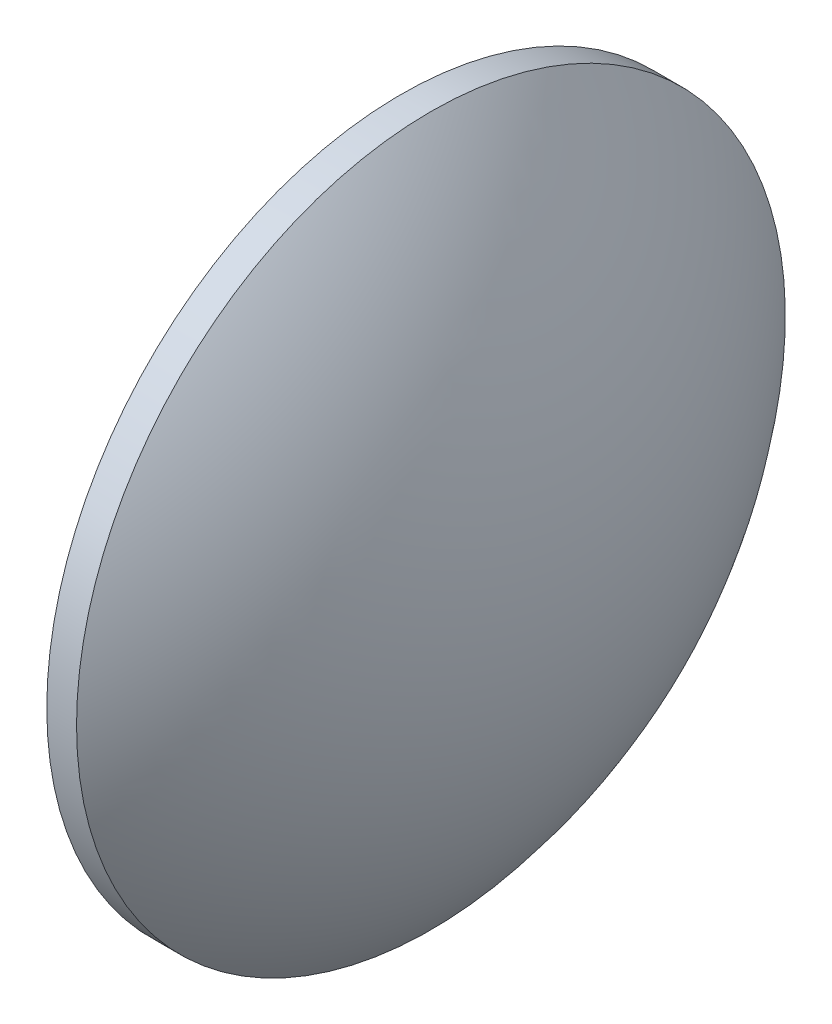
ISO-10303-21;
HEADER;
FILE_DESCRIPTION(('STEP AP214'),'2;1');
FILE_NAME('part.step','',(''),(''),'','','');
FILE_SCHEMA(('AUTOMOTIVE_DESIGN { 1 0 10303 214 1 1 1 1 }'));
ENDSEC;
DATA;
#1=APPLICATION_CONTEXT('core data for automotive mechanical design processes');
#2=APPLICATION_PROTOCOL_DEFINITION('international standard','automotive_design',2000,#1);
#3=PRODUCT_CONTEXT('',#1,'mechanical');
#4=PRODUCT('Part','Part','',(#3));
#5=PRODUCT_RELATED_PRODUCT_CATEGORY('part','',(#4));
#6=PRODUCT_DEFINITION_FORMATION('','',#4);
#7=PRODUCT_DEFINITION_CONTEXT('part definition',#1,'design');
#8=PRODUCT_DEFINITION('design','',#6,#7);
#9=PRODUCT_DEFINITION_SHAPE('','',#8);
#10=(LENGTH_UNIT() NAMED_UNIT(*) SI_UNIT(.MILLI.,.METRE.));
#11=(NAMED_UNIT(*) PLANE_ANGLE_UNIT() SI_UNIT($,.RADIAN.));
#12=(NAMED_UNIT(*) SI_UNIT($,.STERADIAN.) SOLID_ANGLE_UNIT());
#13=UNCERTAINTY_MEASURE_WITH_UNIT(LENGTH_MEASURE(1.E-05),#10,'distance_accuracy_value','');
#14=(GEOMETRIC_REPRESENTATION_CONTEXT(3) GLOBAL_UNCERTAINTY_ASSIGNED_CONTEXT((#13)) GLOBAL_UNIT_ASSIGNED_CONTEXT((#10,
#11,#12)) REPRESENTATION_CONTEXT('',''));
#15=CARTESIAN_POINT('',(0.,0.,0.));
#16=DIRECTION('',(0.,0.,1.));
#17=DIRECTION('',(1.,0.,0.));
#18=AXIS2_PLACEMENT_3D('',#15,#16,#17);
#19=CARTESIAN_POINT('',(490.57632551327,160.834227069943,0.));
#20=DIRECTION('',(-1.,0.,0.));
#21=DIRECTION('',(0.,1.,0.));
#22=AXIS2_PLACEMENT_3D('',#19,#20,#21);
#23=SPHERICAL_SURFACE('',#22,15.4912021857924);
#24=CARTESIAN_POINT('',(502.407527699062,160.834227069943,0.));
#25=DIRECTION('',(-1.,0.,0.));
#26=DIRECTION('',(0.,0.,1.));
#27=AXIS2_PLACEMENT_3D('',#24,#25,#26);
#28=CIRCLE('',#27,10.);
#29=CARTESIAN_POINT('',(502.407527699062,160.834227069943,10.));
#30=VERTEX_POINT('',#29);
#31=EDGE_CURVE('E10',#30,#30,#28,.T.);
#32=ORIENTED_EDGE('',*,*,#31,.F.);
#33=EDGE_LOOP('',(#32));
#34=FACE_BOUND('',#33,.T.);
#35=ADVANCED_FACE('F33',(#34),#23,.T.);
#36=CARTESIAN_POINT('',(496.910941923609,160.834227069943,0.));
#37=DIRECTION('',(-1.,0.,0.));
#38=DIRECTION('',(0.,0.,1.));
#39=AXIS2_PLACEMENT_3D('',#36,#37,#38);
#40=CYLINDRICAL_SURFACE('',#39,10.);
#41=CARTESIAN_POINT('',(501.567527699062,160.834227069943,0.));
#42=DIRECTION('',(-1.,0.,0.));
#43=DIRECTION('',(0.,0.,1.));
#44=AXIS2_PLACEMENT_3D('',#41,#42,#43);
#45=CIRCLE('',#44,10.);
#46=CARTESIAN_POINT('',(501.567527699062,160.834227069943,10.));
#47=VERTEX_POINT('',#46);
#48=EDGE_CURVE('E39',#47,#47,#45,.T.);
#49=ORIENTED_EDGE('',*,*,#48,.F.);
#50=EDGE_LOOP('',(#49));
#51=FACE_BOUND('',#50,.T.);
#52=ORIENTED_EDGE('',*,*,#31,.T.);
#53=EDGE_LOOP('',(#52));
#54=FACE_BOUND('',#53,.T.);
#55=ADVANCED_FACE('F47',(#51,#54),#40,.T.);
#56=CARTESIAN_POINT('',(501.567527699062,160.834227069943,0.));
#57=DIRECTION('',(1.,0.,0.));
#58=DIRECTION('',(0.,0.,-1.));
#59=AXIS2_PLACEMENT_3D('',#56,#57,#58);
#60=PLANE('',#59);
#61=ORIENTED_EDGE('',*,*,#48,.T.);
#62=EDGE_LOOP('',(#61));
#63=FACE_BOUND('',#62,.T.);
#64=ADVANCED_FACE('F45',(#63),#60,.F.);
#65=CLOSED_SHELL('',(#35,#55,#64));
#66=MANIFOLD_SOLID_BREP('B2',#65);
#67=ADVANCED_BREP_SHAPE_REPRESENTATION('',(#18,#66),#14);
#68=SHAPE_DEFINITION_REPRESENTATION(#9,#67);
ENDSEC;
END-ISO-10303-21;
